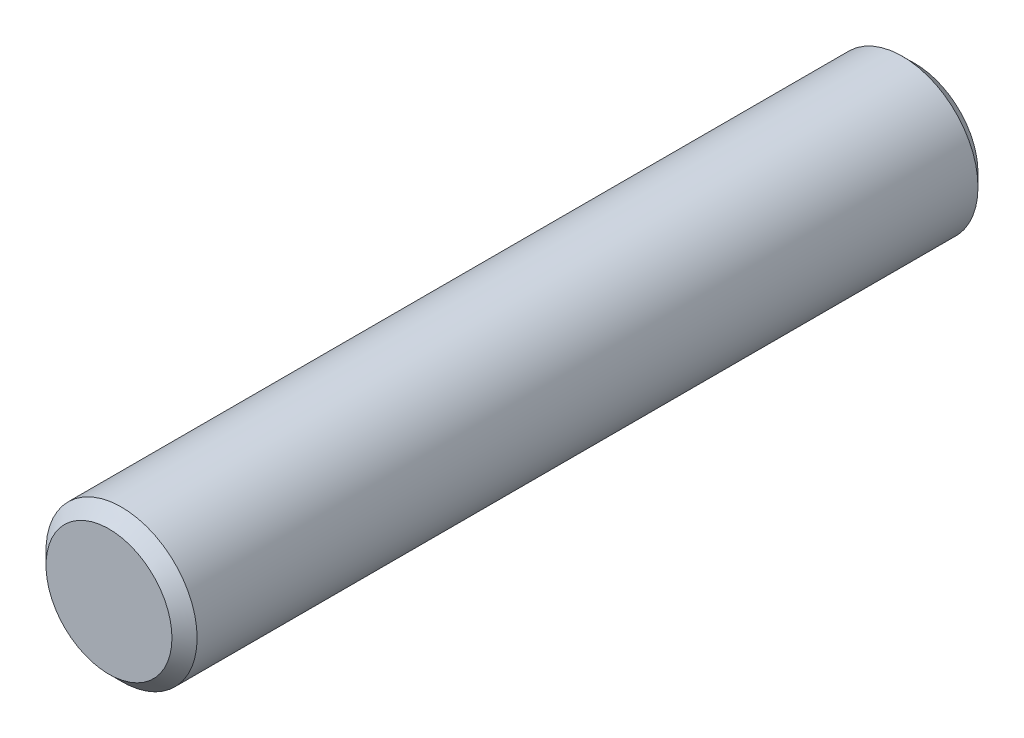
ISO-10303-21;
HEADER;
FILE_DESCRIPTION(('STEP AP214'),'2;1');
FILE_NAME('part.step','',(''),(''),'','','');
FILE_SCHEMA(('AUTOMOTIVE_DESIGN { 1 0 10303 214 1 1 1 1 }'));
ENDSEC;
DATA;
#1=APPLICATION_CONTEXT('core data for automotive mechanical design processes');
#2=APPLICATION_PROTOCOL_DEFINITION('international standard','automotive_design',2000,#1);
#3=PRODUCT_CONTEXT('',#1,'mechanical');
#4=PRODUCT('Part','Part','',(#3));
#5=PRODUCT_RELATED_PRODUCT_CATEGORY('part','',(#4));
#6=PRODUCT_DEFINITION_FORMATION('','',#4);
#7=PRODUCT_DEFINITION_CONTEXT('part definition',#1,'design');
#8=PRODUCT_DEFINITION('design','',#6,#7);
#9=PRODUCT_DEFINITION_SHAPE('','',#8);
#10=(LENGTH_UNIT() NAMED_UNIT(*) SI_UNIT(.MILLI.,.METRE.));
#11=(NAMED_UNIT(*) PLANE_ANGLE_UNIT() SI_UNIT($,.RADIAN.));
#12=(NAMED_UNIT(*) SI_UNIT($,.STERADIAN.) SOLID_ANGLE_UNIT());
#13=UNCERTAINTY_MEASURE_WITH_UNIT(LENGTH_MEASURE(1.E-05),#10,'distance_accuracy_value','');
#14=(GEOMETRIC_REPRESENTATION_CONTEXT(3) GLOBAL_UNCERTAINTY_ASSIGNED_CONTEXT((#13)) GLOBAL_UNIT_ASSIGNED_CONTEXT((#10,
#11,#12)) REPRESENTATION_CONTEXT('',''));
#15=CARTESIAN_POINT('',(0.,0.,0.));
#16=DIRECTION('',(0.,0.,1.));
#17=DIRECTION('',(1.,0.,0.));
#18=AXIS2_PLACEMENT_3D('',#15,#16,#17);
#19=CARTESIAN_POINT('',(0.,0.,32.));
#20=DIRECTION('',(0.,0.,-1.));
#21=DIRECTION('',(-1.,0.,0.));
#22=AXIS2_PLACEMENT_3D('',#19,#20,#21);
#23=CYLINDRICAL_SURFACE('',#22,3.);
#24=CARTESIAN_POINT('',(0.,0.,0.5));
#25=DIRECTION('',(0.,0.,1.));
#26=DIRECTION('',(1.,0.,0.));
#27=AXIS2_PLACEMENT_3D('',#24,#25,#26);
#28=CIRCLE('',#27,3.);
#29=CARTESIAN_POINT('',(3.,0.,0.5));
#30=VERTEX_POINT('',#29);
#31=EDGE_CURVE('E40',#30,#30,#28,.T.);
#32=ORIENTED_EDGE('',*,*,#31,.T.);
#33=EDGE_LOOP('',(#32));
#34=FACE_BOUND('',#33,.T.);
#35=CARTESIAN_POINT('',(0.,0.,31.5));
#36=DIRECTION('',(0.,0.,1.));
#37=DIRECTION('',(1.,0.,0.));
#38=AXIS2_PLACEMENT_3D('',#35,#36,#37);
#39=CIRCLE('',#38,3.);
#40=CARTESIAN_POINT('',(3.,0.,31.5));
#41=VERTEX_POINT('',#40);
#42=EDGE_CURVE('E44',#41,#41,#39,.F.);
#43=ORIENTED_EDGE('',*,*,#42,.T.);
#44=EDGE_LOOP('',(#43));
#45=FACE_BOUND('',#44,.T.);
#46=ADVANCED_FACE('F32',(#34,#45),#23,.T.);
#47=CARTESIAN_POINT('',(0.,0.,32.));
#48=DIRECTION('',(0.,0.,1.));
#49=DIRECTION('',(1.,0.,0.));
#50=AXIS2_PLACEMENT_3D('',#47,#48,#49);
#51=PLANE('',#50);
#52=CARTESIAN_POINT('',(0.,0.,32.));
#53=DIRECTION('',(0.,0.,1.));
#54=DIRECTION('',(1.,0.,0.));
#55=AXIS2_PLACEMENT_3D('',#52,#53,#54);
#56=CIRCLE('',#55,2.5);
#57=CARTESIAN_POINT('',(2.5,0.,32.));
#58=VERTEX_POINT('',#57);
#59=EDGE_CURVE('E48',#58,#58,#56,.T.);
#60=ORIENTED_EDGE('',*,*,#59,.T.);
#61=EDGE_LOOP('',(#60));
#62=FACE_BOUND('',#61,.T.);
#63=ADVANCED_FACE('F54',(#62),#51,.T.);
#64=CARTESIAN_POINT('',(0.,0.,0.));
#65=DIRECTION('',(0.,0.,1.));
#66=DIRECTION('',(1.,0.,0.));
#67=AXIS2_PLACEMENT_3D('',#64,#65,#66);
#68=PLANE('',#67);
#69=CARTESIAN_POINT('',(0.,0.,0.));
#70=DIRECTION('',(0.,0.,1.));
#71=DIRECTION('',(1.,0.,0.));
#72=AXIS2_PLACEMENT_3D('',#69,#70,#71);
#73=CIRCLE('',#72,2.5);
#74=CARTESIAN_POINT('',(2.5,0.,0.));
#75=VERTEX_POINT('',#74);
#76=EDGE_CURVE('E10',#75,#75,#73,.F.);
#77=ORIENTED_EDGE('',*,*,#76,.T.);
#78=EDGE_LOOP('',(#77));
#79=FACE_BOUND('',#78,.T.);
#80=ADVANCED_FACE('F58',(#79),#68,.F.);
#81=CARTESIAN_POINT('',(0.,0.,32.));
#82=DIRECTION('',(0.,0.,-1.));
#83=DIRECTION('',(-1.,0.,0.));
#84=AXIS2_PLACEMENT_3D('',#81,#82,#83);
#85=CONICAL_SURFACE('',#84,2.5,0.785398163397441);
#86=ORIENTED_EDGE('',*,*,#42,.F.);
#87=EDGE_LOOP('',(#86));
#88=FACE_BOUND('',#87,.T.);
#89=ORIENTED_EDGE('',*,*,#59,.F.);
#90=EDGE_LOOP('',(#89));
#91=FACE_BOUND('',#90,.T.);
#92=ADVANCED_FACE('F56',(#88,#91),#85,.T.);
#93=CARTESIAN_POINT('',(0.,0.,0.5));
#94=DIRECTION('',(0.,0.,1.));
#95=DIRECTION('',(1.,0.,0.));
#96=AXIS2_PLACEMENT_3D('',#93,#94,#95);
#97=CONICAL_SURFACE('',#96,3.,0.785398163397452);
#98=ORIENTED_EDGE('',*,*,#76,.F.);
#99=EDGE_LOOP('',(#98));
#100=FACE_BOUND('',#99,.T.);
#101=ORIENTED_EDGE('',*,*,#31,.F.);
#102=EDGE_LOOP('',(#101));
#103=FACE_BOUND('',#102,.T.);
#104=ADVANCED_FACE('F35',(#100,#103),#97,.T.);
#105=CLOSED_SHELL('',(#46,#63,#80,#92,#104));
#106=MANIFOLD_SOLID_BREP('B2',#105);
#107=ADVANCED_BREP_SHAPE_REPRESENTATION('',(#18,#106),#14);
#108=SHAPE_DEFINITION_REPRESENTATION(#9,#107);
ENDSEC;
END-ISO-10303-21;
